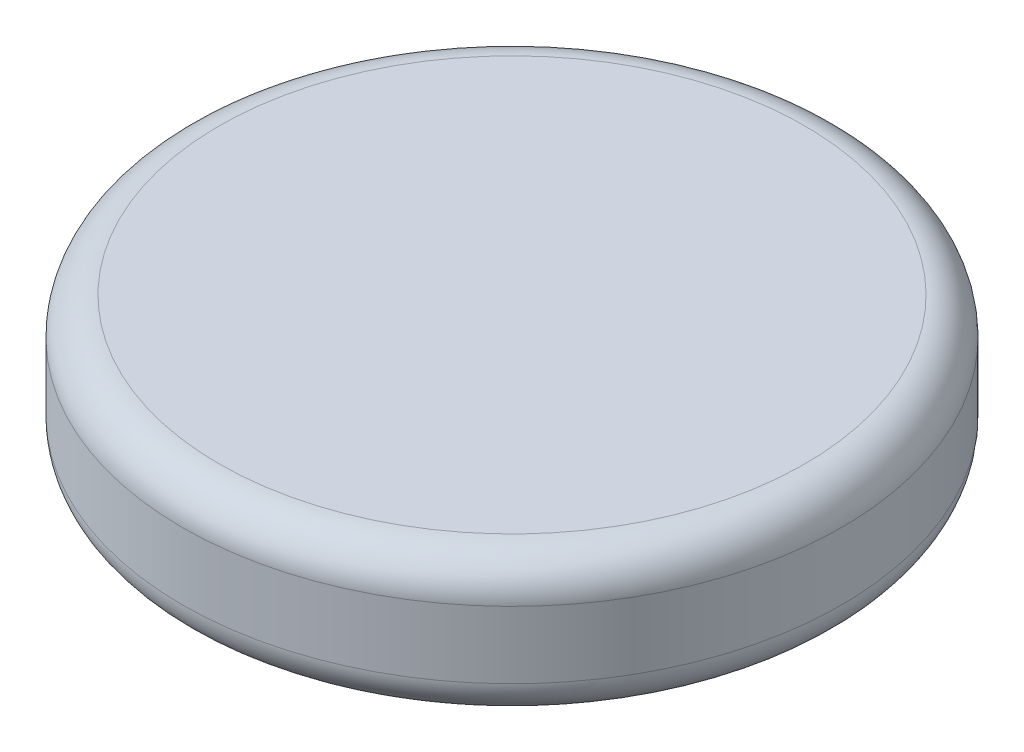
ISO-10303-21;
HEADER;
FILE_DESCRIPTION(('STEP AP214'),'2;1');
FILE_NAME('part.step','',(''),(''),'','','');
FILE_SCHEMA(('AUTOMOTIVE_DESIGN { 1 0 10303 214 1 1 1 1 }'));
ENDSEC;
DATA;
#1=APPLICATION_CONTEXT('core data for automotive mechanical design processes');
#2=APPLICATION_PROTOCOL_DEFINITION('international standard','automotive_design',2000,#1);
#3=PRODUCT_CONTEXT('',#1,'mechanical');
#4=PRODUCT('Part','Part','',(#3));
#5=PRODUCT_RELATED_PRODUCT_CATEGORY('part','',(#4));
#6=PRODUCT_DEFINITION_FORMATION('','',#4);
#7=PRODUCT_DEFINITION_CONTEXT('part definition',#1,'design');
#8=PRODUCT_DEFINITION('design','',#6,#7);
#9=PRODUCT_DEFINITION_SHAPE('','',#8);
#10=(LENGTH_UNIT() NAMED_UNIT(*) SI_UNIT(.MILLI.,.METRE.));
#11=(NAMED_UNIT(*) PLANE_ANGLE_UNIT() SI_UNIT($,.RADIAN.));
#12=(NAMED_UNIT(*) SI_UNIT($,.STERADIAN.) SOLID_ANGLE_UNIT());
#13=UNCERTAINTY_MEASURE_WITH_UNIT(LENGTH_MEASURE(1.E-05),#10,'distance_accuracy_value','');
#14=(GEOMETRIC_REPRESENTATION_CONTEXT(3) GLOBAL_UNCERTAINTY_ASSIGNED_CONTEXT((#13)) GLOBAL_UNIT_ASSIGNED_CONTEXT((#10,
#11,#12)) REPRESENTATION_CONTEXT('',''));
#15=CARTESIAN_POINT('',(0.,0.,0.));
#16=DIRECTION('',(0.,0.,1.));
#17=DIRECTION('',(1.,0.,0.));
#18=AXIS2_PLACEMENT_3D('',#15,#16,#17);
#19=CARTESIAN_POINT('',(0.,6.7945,0.));
#20=DIRECTION('',(0.,-1.,0.));
#21=DIRECTION('',(0.,0.,-1.));
#22=AXIS2_PLACEMENT_3D('',#19,#20,#21);
#23=CYLINDRICAL_SURFACE('',#22,15.9385);
#24=CARTESIAN_POINT('',(0.,1.778,0.));
#25=DIRECTION('',(0.,1.,0.));
#26=DIRECTION('',(0.,0.,1.));
#27=AXIS2_PLACEMENT_3D('',#24,#25,#26);
#28=CIRCLE('',#27,15.9385);
#29=CARTESIAN_POINT('',(0.,1.778,15.9385));
#30=VERTEX_POINT('',#29);
#31=EDGE_CURVE('E47',#30,#30,#28,.T.);
#32=ORIENTED_EDGE('',*,*,#31,.T.);
#33=EDGE_LOOP('',(#32));
#34=FACE_BOUND('',#33,.T.);
#35=CARTESIAN_POINT('',(0.,5.0165,0.));
#36=DIRECTION('',(0.,1.,0.));
#37=DIRECTION('',(0.,0.,1.));
#38=AXIS2_PLACEMENT_3D('',#35,#36,#37);
#39=CIRCLE('',#38,15.9385);
#40=CARTESIAN_POINT('',(0.,5.0165,15.9385));
#41=VERTEX_POINT('',#40);
#42=EDGE_CURVE('E51',#41,#41,#39,.F.);
#43=ORIENTED_EDGE('',*,*,#42,.T.);
#44=EDGE_LOOP('',(#43));
#45=FACE_BOUND('',#44,.T.);
#46=ADVANCED_FACE('F36',(#34,#45),#23,.T.);
#47=CARTESIAN_POINT('',(0.,6.7945,0.));
#48=DIRECTION('',(0.,1.,0.));
#49=DIRECTION('',(0.,0.,1.));
#50=AXIS2_PLACEMENT_3D('',#47,#48,#49);
#51=PLANE('',#50);
#52=CARTESIAN_POINT('',(0.,6.7945,0.));
#53=DIRECTION('',(0.,1.,0.));
#54=DIRECTION('',(0.,0.,1.));
#55=AXIS2_PLACEMENT_3D('',#52,#53,#54);
#56=CIRCLE('',#55,14.1605);
#57=CARTESIAN_POINT('',(0.,6.7945,14.1605));
#58=VERTEX_POINT('',#57);
#59=EDGE_CURVE('E10',#58,#58,#56,.T.);
#60=ORIENTED_EDGE('',*,*,#59,.T.);
#61=EDGE_LOOP('',(#60));
#62=FACE_BOUND('',#61,.T.);
#63=ADVANCED_FACE('F67',(#62),#51,.T.);
#64=CARTESIAN_POINT('',(0.,0.,0.));
#65=DIRECTION('',(0.,1.,0.));
#66=DIRECTION('',(0.,0.,1.));
#67=AXIS2_PLACEMENT_3D('',#64,#65,#66);
#68=PLANE('',#67);
#69=CARTESIAN_POINT('',(0.,0.,0.));
#70=DIRECTION('',(0.,1.,0.));
#71=DIRECTION('',(0.,0.,1.));
#72=AXIS2_PLACEMENT_3D('',#69,#70,#71);
#73=CIRCLE('',#72,14.1605);
#74=CARTESIAN_POINT('',(0.,0.,14.1605));
#75=VERTEX_POINT('',#74);
#76=EDGE_CURVE('E43',#75,#75,#73,.F.);
#77=ORIENTED_EDGE('',*,*,#76,.T.);
#78=EDGE_LOOP('',(#77));
#79=FACE_BOUND('',#78,.T.);
#80=ADVANCED_FACE('F64',(#79),#68,.F.);
#81=CARTESIAN_POINT('',(0.,1.778,0.));
#82=DIRECTION('',(0.,1.,0.));
#83=DIRECTION('',(0.,0.,1.));
#84=AXIS2_PLACEMENT_3D('',#81,#82,#83);
#85=TOROIDAL_SURFACE('',#84,14.1605,1.778);
#86=ORIENTED_EDGE('',*,*,#76,.F.);
#87=EDGE_LOOP('',(#86));
#88=FACE_BOUND('',#87,.T.);
#89=ORIENTED_EDGE('',*,*,#31,.F.);
#90=EDGE_LOOP('',(#89));
#91=FACE_BOUND('',#90,.T.);
#92=ADVANCED_FACE('F60',(#88,#91),#85,.T.);
#93=CARTESIAN_POINT('',(0.,5.0165,0.));
#94=DIRECTION('',(0.,1.,0.));
#95=DIRECTION('',(0.,0.,1.));
#96=AXIS2_PLACEMENT_3D('',#93,#94,#95);
#97=TOROIDAL_SURFACE('',#96,14.1605,1.778);
#98=ORIENTED_EDGE('',*,*,#42,.F.);
#99=EDGE_LOOP('',(#98));
#100=FACE_BOUND('',#99,.T.);
#101=ORIENTED_EDGE('',*,*,#59,.F.);
#102=EDGE_LOOP('',(#101));
#103=FACE_BOUND('',#102,.T.);
#104=ADVANCED_FACE('F38',(#100,#103),#97,.T.);
#105=CLOSED_SHELL('',(#46,#63,#80,#92,#104));
#106=MANIFOLD_SOLID_BREP('B2',#105);
#107=ADVANCED_BREP_SHAPE_REPRESENTATION('',(#18,#106),#14);
#108=SHAPE_DEFINITION_REPRESENTATION(#9,#107);
ENDSEC;
END-ISO-10303-21;
